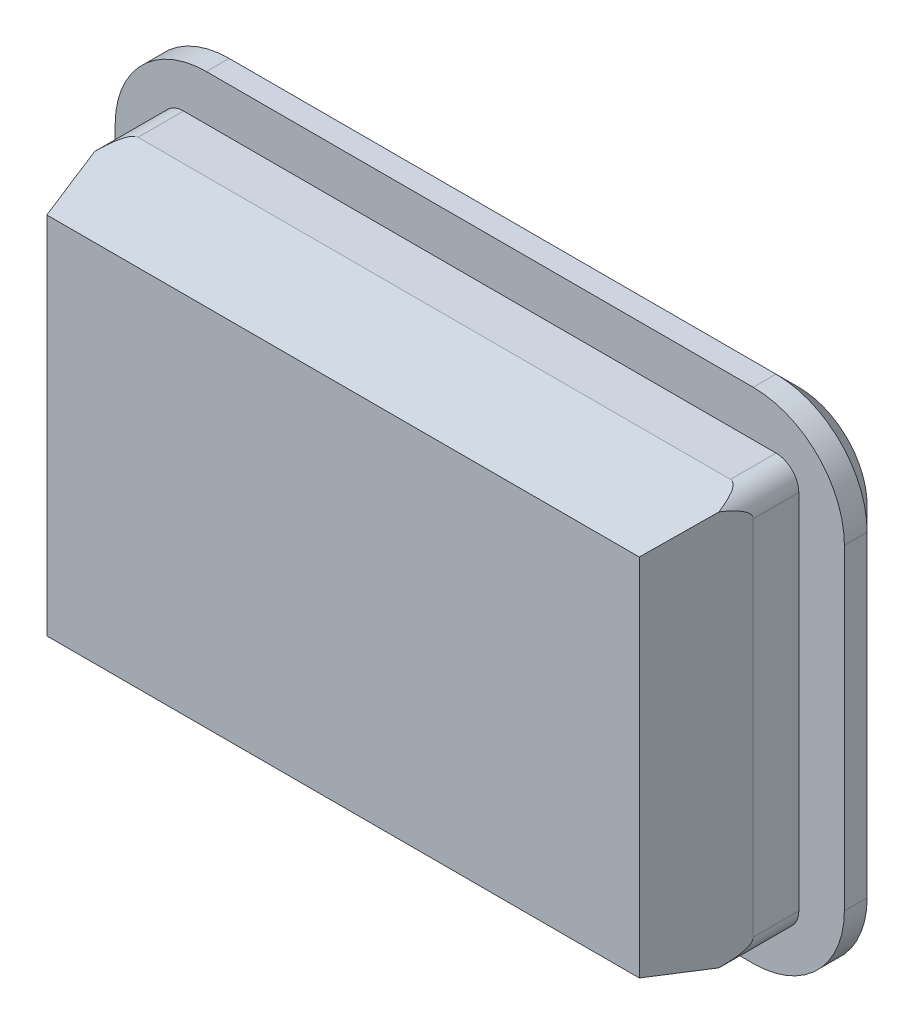
ISO-10303-21;
HEADER;
FILE_DESCRIPTION(('STEP AP214'),'2;1');
FILE_NAME('part.step','',(''),(''),'','','');
FILE_SCHEMA(('AUTOMOTIVE_DESIGN { 1 0 10303 214 1 1 1 1 }'));
ENDSEC;
DATA;
#1=APPLICATION_CONTEXT('core data for automotive mechanical design processes');
#2=APPLICATION_PROTOCOL_DEFINITION('international standard','automotive_design',2000,#1);
#3=PRODUCT_CONTEXT('',#1,'mechanical');
#4=PRODUCT('Part','Part','',(#3));
#5=PRODUCT_RELATED_PRODUCT_CATEGORY('part','',(#4));
#6=PRODUCT_DEFINITION_FORMATION('','',#4);
#7=PRODUCT_DEFINITION_CONTEXT('part definition',#1,'design');
#8=PRODUCT_DEFINITION('design','',#6,#7);
#9=PRODUCT_DEFINITION_SHAPE('','',#8);
#10=(LENGTH_UNIT() NAMED_UNIT(*) SI_UNIT(.MILLI.,.METRE.));
#11=(NAMED_UNIT(*) PLANE_ANGLE_UNIT() SI_UNIT($,.RADIAN.));
#12=(NAMED_UNIT(*) SI_UNIT($,.STERADIAN.) SOLID_ANGLE_UNIT());
#13=UNCERTAINTY_MEASURE_WITH_UNIT(LENGTH_MEASURE(1.E-05),#10,'distance_accuracy_value','');
#14=(GEOMETRIC_REPRESENTATION_CONTEXT(3) GLOBAL_UNCERTAINTY_ASSIGNED_CONTEXT((#13)) GLOBAL_UNIT_ASSIGNED_CONTEXT((#10,
#11,#12)) REPRESENTATION_CONTEXT('',''));
#15=CARTESIAN_POINT('',(0.,0.,0.));
#16=DIRECTION('',(0.,0.,1.));
#17=DIRECTION('',(1.,0.,0.));
#18=AXIS2_PLACEMENT_3D('',#15,#16,#17);
#19=CARTESIAN_POINT('',(0.,0.,2.));
#20=DIRECTION('',(0.,0.,-1.));
#21=DIRECTION('',(-1.,0.,0.));
#22=AXIS2_PLACEMENT_3D('',#19,#20,#21);
#23=PLANE('',#22);
#24=DIRECTION('',(0.,1.,0.));
#25=VECTOR('',#24,1.);
#26=CARTESIAN_POINT('',(6.5,-4.,2.));
#27=LINE('',#26,#25);
#28=CARTESIAN_POINT('',(6.5,-4.,2.));
#29=VERTEX_POINT('',#28);
#30=CARTESIAN_POINT('',(6.5,4.,2.));
#31=VERTEX_POINT('',#30);
#32=EDGE_CURVE('E280',#29,#31,#27,.T.);
#33=ORIENTED_EDGE('',*,*,#32,.T.);
#34=DIRECTION('',(-1.,0.,0.));
#35=VECTOR('',#34,1.);
#36=CARTESIAN_POINT('',(-6.5,4.,2.));
#37=LINE('',#36,#35);
#38=CARTESIAN_POINT('',(-6.5,4.,2.));
#39=VERTEX_POINT('',#38);
#40=EDGE_CURVE('E236',#31,#39,#37,.T.);
#41=ORIENTED_EDGE('',*,*,#40,.T.);
#42=DIRECTION('',(0.,-1.,0.));
#43=VECTOR('',#42,1.);
#44=CARTESIAN_POINT('',(-6.5,-4.,2.));
#45=LINE('',#44,#43);
#46=CARTESIAN_POINT('',(-6.5,-4.,2.));
#47=VERTEX_POINT('',#46);
#48=EDGE_CURVE('E212',#39,#47,#45,.T.);
#49=ORIENTED_EDGE('',*,*,#48,.T.);
#50=DIRECTION('',(1.,0.,0.));
#51=VECTOR('',#50,1.);
#52=CARTESIAN_POINT('',(-6.5,-4.,2.));
#53=LINE('',#52,#51);
#54=EDGE_CURVE('E222',#47,#29,#53,.T.);
#55=ORIENTED_EDGE('',*,*,#54,.T.);
#56=EDGE_LOOP('',(#33,#41,#49,#55));
#57=FACE_BOUND('',#56,.T.);
#58=ADVANCED_FACE('F43',(#57),#23,.F.);
#59=CARTESIAN_POINT('',(6.58823529411765,0.,1.64705882352942));
#60=DIRECTION('',(0.970142500145332,0.,0.242535625036334));
#61=DIRECTION('',(0.242535625036334,0.,-0.970142500145332));
#62=AXIS2_PLACEMENT_3D('',#59,#60,#61);
#63=PLANE('',#62);
#64=DIRECTION('',(0.236343225784556,-0.224526064495328,-0.945372903138222));
#65=VECTOR('',#64,1.);
#66=CARTESIAN_POINT('',(6.5,-4.,2.));
#67=LINE('',#66,#65);
#68=CARTESIAN_POINT('',(6.84977789098792,-4.33228899643852,0.600888436048335));
#69=VERTEX_POINT('',#68);
#70=EDGE_CURVE('E226',#29,#69,#67,.T.);
#71=ORIENTED_EDGE('',*,*,#70,.T.);
#72=CARTESIAN_POINT('',(6.5,-3.975,1.99999999999999));
#73=DIRECTION('',(0.970142500145332,0.,0.242535625036334));
#74=DIRECTION('',(-0.242535625036334,0.,0.970142500145332));
#75=AXIS2_PLACEMENT_3D('',#72,#73,#74);
#76=ELLIPSE('',#75,2.06155281280882,0.5);
#77=CARTESIAN_POINT('',(7.,-3.975,0.));
#78=VERTEX_POINT('',#77);
#79=EDGE_CURVE('E869',#69,#78,#76,.T.);
#80=ORIENTED_EDGE('',*,*,#79,.T.);
#81=DIRECTION('',(0.,1.,0.));
#82=VECTOR('',#81,1.);
#83=CARTESIAN_POINT('',(7.,-4.475,0.));
#84=LINE('',#83,#82);
#85=CARTESIAN_POINT('',(7.,3.975,0.));
#86=VERTEX_POINT('',#85);
#87=EDGE_CURVE('E300',#78,#86,#84,.T.);
#88=ORIENTED_EDGE('',*,*,#87,.T.);
#89=CARTESIAN_POINT('',(6.5,3.975,1.99999999999999));
#90=DIRECTION('',(0.970142500145332,0.,0.242535625036334));
#91=DIRECTION('',(-0.242535625036334,0.,0.970142500145332));
#92=AXIS2_PLACEMENT_3D('',#89,#90,#91);
#93=ELLIPSE('',#92,2.06155281280882,0.5);
#94=CARTESIAN_POINT('',(6.84977789098792,4.33228899643852,0.600888436048335));
#95=VERTEX_POINT('',#94);
#96=EDGE_CURVE('E868',#86,#95,#93,.T.);
#97=ORIENTED_EDGE('',*,*,#96,.T.);
#98=DIRECTION('',(0.236343225784556,0.224526064495328,-0.945372903138222));
#99=VECTOR('',#98,1.);
#100=CARTESIAN_POINT('',(6.5,4.,2.));
#101=LINE('',#100,#99);
#102=EDGE_CURVE('E219',#31,#95,#101,.T.);
#103=ORIENTED_EDGE('',*,*,#102,.F.);
#104=ORIENTED_EDGE('',*,*,#32,.F.);
#105=EDGE_LOOP('',(#71,#80,#88,#97,#103,#104));
#106=FACE_BOUND('',#105,.T.);
#107=ADVANCED_FACE('F256',(#106),#63,.T.);
#108=CARTESIAN_POINT('',(0.,4.23605975447419,1.00606419168762));
#109=DIRECTION('',(0.,0.972936550719561,0.231072430795896));
#110=DIRECTION('',(0.,-0.231072430795896,0.972936550719561));
#111=AXIS2_PLACEMENT_3D('',#108,#109,#110);
#112=PLANE('',#111);
#113=DIRECTION('',(-1.,0.,0.));
#114=VECTOR('',#113,1.);
#115=CARTESIAN_POINT('',(-7.,4.475,0.));
#116=LINE('',#115,#114);
#117=CARTESIAN_POINT('',(6.5,4.475,0.));
#118=VERTEX_POINT('',#117);
#119=CARTESIAN_POINT('',(-6.5,4.475,0.));
#120=VERTEX_POINT('',#119);
#121=EDGE_CURVE('E47',#118,#120,#116,.T.);
#122=ORIENTED_EDGE('',*,*,#121,.T.);
#123=CARTESIAN_POINT('',(-6.5,3.975,2.10526315789474));
#124=DIRECTION('',(0.,0.972936550719561,0.231072430795896));
#125=DIRECTION('',(0.,-0.231072430795896,0.972936550719561));
#126=AXIS2_PLACEMENT_3D('',#123,#124,#125);
#127=ELLIPSE('',#126,2.16382369059702,0.5);
#128=CARTESIAN_POINT('',(-6.84977789098792,4.33228899643852,0.600888436048336));
#129=VERTEX_POINT('',#128);
#130=EDGE_CURVE('E908',#120,#129,#127,.T.);
#131=ORIENTED_EDGE('',*,*,#130,.T.);
#132=DIRECTION('',(-0.236343225784555,0.224526064495328,-0.945372903138222));
#133=VECTOR('',#132,1.);
#134=CARTESIAN_POINT('',(-6.5,4.,2.));
#135=LINE('',#134,#133);
#136=EDGE_CURVE('E218',#39,#129,#135,.T.);
#137=ORIENTED_EDGE('',*,*,#136,.F.);
#138=ORIENTED_EDGE('',*,*,#40,.F.);
#139=ORIENTED_EDGE('',*,*,#102,.T.);
#140=CARTESIAN_POINT('',(6.5,3.975,2.10526315789474));
#141=DIRECTION('',(0.,0.972936550719561,0.231072430795896));
#142=DIRECTION('',(0.,-0.231072430795896,0.972936550719561));
#143=AXIS2_PLACEMENT_3D('',#140,#141,#142);
#144=ELLIPSE('',#143,2.16382369059702,0.5);
#145=EDGE_CURVE('E906',#95,#118,#144,.T.);
#146=ORIENTED_EDGE('',*,*,#145,.T.);
#147=EDGE_LOOP('',(#122,#131,#137,#138,#139,#146));
#148=FACE_BOUND('',#147,.T.);
#149=ADVANCED_FACE('F322',(#148),#112,.T.);
#150=CARTESIAN_POINT('',(0.,-4.23605975447419,1.00606419168762));
#151=DIRECTION('',(0.,-0.972936550719561,0.231072430795895));
#152=DIRECTION('',(0.,-0.231072430795896,-0.972936550719561));
#153=AXIS2_PLACEMENT_3D('',#150,#151,#152);
#154=PLANE('',#153);
#155=DIRECTION('',(-0.236343225784555,-0.224526064495328,-0.945372903138222));
#156=VECTOR('',#155,1.);
#157=CARTESIAN_POINT('',(-6.5,-4.,2.));
#158=LINE('',#157,#156);
#159=CARTESIAN_POINT('',(-6.84977789098792,-4.33228899643852,0.600888436048336));
#160=VERTEX_POINT('',#159);
#161=EDGE_CURVE('E206',#47,#160,#158,.T.);
#162=ORIENTED_EDGE('',*,*,#161,.T.);
#163=CARTESIAN_POINT('',(-6.5,-3.975,2.10526315789474));
#164=DIRECTION('',(0.,-0.972936550719561,0.231072430795895));
#165=DIRECTION('',(0.,0.231072430795896,0.972936550719561));
#166=AXIS2_PLACEMENT_3D('',#163,#164,#165);
#167=ELLIPSE('',#166,2.16382369059702,0.5);
#168=CARTESIAN_POINT('',(-6.5,-4.475,0.));
#169=VERTEX_POINT('',#168);
#170=EDGE_CURVE('E893',#160,#169,#167,.T.);
#171=ORIENTED_EDGE('',*,*,#170,.T.);
#172=DIRECTION('',(1.,0.,0.));
#173=VECTOR('',#172,1.);
#174=CARTESIAN_POINT('',(-7.,-4.475,0.));
#175=LINE('',#174,#173);
#176=CARTESIAN_POINT('',(6.5,-4.475,0.));
#177=VERTEX_POINT('',#176);
#178=EDGE_CURVE('E295',#169,#177,#175,.T.);
#179=ORIENTED_EDGE('',*,*,#178,.T.);
#180=CARTESIAN_POINT('',(6.5,-3.975,2.10526315789474));
#181=DIRECTION('',(0.,-0.972936550719561,0.231072430795895));
#182=DIRECTION('',(0.,0.231072430795896,0.972936550719561));
#183=AXIS2_PLACEMENT_3D('',#180,#181,#182);
#184=ELLIPSE('',#183,2.16382369059702,0.5);
#185=EDGE_CURVE('E428',#177,#69,#184,.T.);
#186=ORIENTED_EDGE('',*,*,#185,.T.);
#187=ORIENTED_EDGE('',*,*,#70,.F.);
#188=ORIENTED_EDGE('',*,*,#54,.F.);
#189=EDGE_LOOP('',(#162,#171,#179,#186,#187,#188));
#190=FACE_BOUND('',#189,.T.);
#191=ADVANCED_FACE('F224',(#190),#154,.T.);
#192=CARTESIAN_POINT('',(-6.58823529411765,0.,1.64705882352941));
#193=DIRECTION('',(-0.970142500145332,0.,0.242535625036333));
#194=DIRECTION('',(0.242535625036333,0.,0.970142500145332));
#195=AXIS2_PLACEMENT_3D('',#192,#193,#194);
#196=PLANE('',#195);
#197=DIRECTION('',(0.,-1.,0.));
#198=VECTOR('',#197,1.);
#199=CARTESIAN_POINT('',(-7.,-4.475,0.));
#200=LINE('',#199,#198);
#201=CARTESIAN_POINT('',(-7.,3.975,0.));
#202=VERTEX_POINT('',#201);
#203=CARTESIAN_POINT('',(-7.,-3.975,0.));
#204=VERTEX_POINT('',#203);
#205=EDGE_CURVE('E299',#202,#204,#200,.T.);
#206=ORIENTED_EDGE('',*,*,#205,.T.);
#207=CARTESIAN_POINT('',(-6.5,-3.975,1.99999999999999));
#208=DIRECTION('',(-0.970142500145332,0.,0.242535625036333));
#209=DIRECTION('',(0.242535625036333,0.,0.970142500145332));
#210=AXIS2_PLACEMENT_3D('',#207,#208,#209);
#211=ELLIPSE('',#210,2.06155281280883,0.5);
#212=EDGE_CURVE('E215',#204,#160,#211,.T.);
#213=ORIENTED_EDGE('',*,*,#212,.T.);
#214=ORIENTED_EDGE('',*,*,#161,.F.);
#215=ORIENTED_EDGE('',*,*,#48,.F.);
#216=ORIENTED_EDGE('',*,*,#136,.T.);
#217=CARTESIAN_POINT('',(-6.5,3.975,1.99999999999999));
#218=DIRECTION('',(-0.970142500145332,0.,0.242535625036333));
#219=DIRECTION('',(0.242535625036333,0.,0.970142500145332));
#220=AXIS2_PLACEMENT_3D('',#217,#218,#219);
#221=ELLIPSE('',#220,2.06155281280883,0.5);
#222=EDGE_CURVE('E421',#129,#202,#221,.T.);
#223=ORIENTED_EDGE('',*,*,#222,.T.);
#224=EDGE_LOOP('',(#206,#213,#214,#215,#216,#223));
#225=FACE_BOUND('',#224,.T.);
#226=ADVANCED_FACE('F209',(#225),#196,.T.);
#227=CARTESIAN_POINT('',(-7.,4.475,-1.));
#228=DIRECTION('',(0.,-1.,0.));
#229=DIRECTION('',(0.,0.,-1.));
#230=AXIS2_PLACEMENT_3D('',#227,#228,#229);
#231=PLANE('',#230);
#232=DIRECTION('',(1.,0.,0.));
#233=VECTOR('',#232,1.);
#234=CARTESIAN_POINT('',(-7.,4.475,-1.));
#235=LINE('',#234,#233);
#236=CARTESIAN_POINT('',(-6.5,4.475,-1.));
#237=VERTEX_POINT('',#236);
#238=CARTESIAN_POINT('',(6.5,4.475,-1.));
#239=VERTEX_POINT('',#238);
#240=EDGE_CURVE('E463',#237,#239,#235,.T.);
#241=ORIENTED_EDGE('',*,*,#240,.F.);
#242=DIRECTION('',(0.,0.,1.));
#243=VECTOR('',#242,1.);
#244=CARTESIAN_POINT('',(-6.5,4.475,-1.));
#245=LINE('',#244,#243);
#246=EDGE_CURVE('E904',#237,#120,#245,.T.);
#247=ORIENTED_EDGE('',*,*,#246,.T.);
#248=ORIENTED_EDGE('',*,*,#121,.F.);
#249=DIRECTION('',(0.,0.,1.));
#250=VECTOR('',#249,1.);
#251=CARTESIAN_POINT('',(6.5,4.475,-1.));
#252=LINE('',#251,#250);
#253=EDGE_CURVE('E359',#118,#239,#252,.F.);
#254=ORIENTED_EDGE('',*,*,#253,.T.);
#255=EDGE_LOOP('',(#241,#247,#248,#254));
#256=FACE_BOUND('',#255,.T.);
#257=ADVANCED_FACE('F257',(#256),#231,.F.);
#258=CARTESIAN_POINT('',(7.,4.475,-1.));
#259=DIRECTION('',(-1.,0.,0.));
#260=DIRECTION('',(0.,0.,1.));
#261=AXIS2_PLACEMENT_3D('',#258,#259,#260);
#262=PLANE('',#261);
#263=ORIENTED_EDGE('',*,*,#87,.F.);
#264=DIRECTION('',(0.,0.,1.));
#265=VECTOR('',#264,1.);
#266=CARTESIAN_POINT('',(7.,-3.975,-1.));
#267=LINE('',#266,#265);
#268=CARTESIAN_POINT('',(7.,-3.975,-1.));
#269=VERTEX_POINT('',#268);
#270=EDGE_CURVE('E61',#78,#269,#267,.F.);
#271=ORIENTED_EDGE('',*,*,#270,.T.);
#272=DIRECTION('',(0.,-1.,0.));
#273=VECTOR('',#272,1.);
#274=CARTESIAN_POINT('',(7.,4.475,-1.));
#275=LINE('',#274,#273);
#276=CARTESIAN_POINT('',(7.,3.975,-1.));
#277=VERTEX_POINT('',#276);
#278=EDGE_CURVE('E459',#277,#269,#275,.T.);
#279=ORIENTED_EDGE('',*,*,#278,.F.);
#280=DIRECTION('',(0.,0.,1.));
#281=VECTOR('',#280,1.);
#282=CARTESIAN_POINT('',(7.,3.975,-1.));
#283=LINE('',#282,#281);
#284=EDGE_CURVE('E867',#277,#86,#283,.T.);
#285=ORIENTED_EDGE('',*,*,#284,.T.);
#286=EDGE_LOOP('',(#263,#271,#279,#285));
#287=FACE_BOUND('',#286,.T.);
#288=ADVANCED_FACE('F378',(#287),#262,.F.);
#289=CARTESIAN_POINT('',(7.,-4.475,-1.));
#290=DIRECTION('',(0.,1.,0.));
#291=DIRECTION('',(0.,0.,1.));
#292=AXIS2_PLACEMENT_3D('',#289,#290,#291);
#293=PLANE('',#292);
#294=ORIENTED_EDGE('',*,*,#178,.F.);
#295=DIRECTION('',(0.,0.,1.));
#296=VECTOR('',#295,1.);
#297=CARTESIAN_POINT('',(-6.5,-4.475,-1.));
#298=LINE('',#297,#296);
#299=CARTESIAN_POINT('',(-6.5,-4.475,-1.));
#300=VERTEX_POINT('',#299);
#301=EDGE_CURVE('E892',#169,#300,#298,.F.);
#302=ORIENTED_EDGE('',*,*,#301,.T.);
#303=DIRECTION('',(-1.,0.,0.));
#304=VECTOR('',#303,1.);
#305=CARTESIAN_POINT('',(7.,-4.475,-1.));
#306=LINE('',#305,#304);
#307=CARTESIAN_POINT('',(6.5,-4.475,-1.));
#308=VERTEX_POINT('',#307);
#309=EDGE_CURVE('E454',#308,#300,#306,.T.);
#310=ORIENTED_EDGE('',*,*,#309,.F.);
#311=DIRECTION('',(0.,0.,1.));
#312=VECTOR('',#311,1.);
#313=CARTESIAN_POINT('',(6.5,-4.475,-1.));
#314=LINE('',#313,#312);
#315=EDGE_CURVE('E890',#308,#177,#314,.T.);
#316=ORIENTED_EDGE('',*,*,#315,.T.);
#317=EDGE_LOOP('',(#294,#302,#310,#316));
#318=FACE_BOUND('',#317,.T.);
#319=ADVANCED_FACE('F386',(#318),#293,.F.);
#320=CARTESIAN_POINT('',(-7.,-4.475,-1.));
#321=DIRECTION('',(1.,0.,0.));
#322=DIRECTION('',(0.,0.,-1.));
#323=AXIS2_PLACEMENT_3D('',#320,#321,#322);
#324=PLANE('',#323);
#325=DIRECTION('',(0.,1.,0.));
#326=VECTOR('',#325,1.);
#327=CARTESIAN_POINT('',(-7.,-4.475,-1.));
#328=LINE('',#327,#326);
#329=CARTESIAN_POINT('',(-7.,-3.975,-1.));
#330=VERTEX_POINT('',#329);
#331=CARTESIAN_POINT('',(-7.,3.975,-1.));
#332=VERTEX_POINT('',#331);
#333=EDGE_CURVE('E452',#330,#332,#328,.T.);
#334=ORIENTED_EDGE('',*,*,#333,.F.);
#335=DIRECTION('',(0.,0.,1.));
#336=VECTOR('',#335,1.);
#337=CARTESIAN_POINT('',(-7.,-3.975,-1.));
#338=LINE('',#337,#336);
#339=EDGE_CURVE('E416',#330,#204,#338,.T.);
#340=ORIENTED_EDGE('',*,*,#339,.T.);
#341=ORIENTED_EDGE('',*,*,#205,.F.);
#342=DIRECTION('',(0.,0.,1.));
#343=VECTOR('',#342,1.);
#344=CARTESIAN_POINT('',(-7.,3.975,-1.));
#345=LINE('',#344,#343);
#346=EDGE_CURVE('E414',#202,#332,#345,.F.);
#347=ORIENTED_EDGE('',*,*,#346,.T.);
#348=EDGE_LOOP('',(#334,#340,#341,#347));
#349=FACE_BOUND('',#348,.T.);
#350=ADVANCED_FACE('F390',(#349),#324,.F.);
#351=CARTESIAN_POINT('',(-8.,-5.475,-2.));
#352=DIRECTION('',(1.,0.,0.));
#353=DIRECTION('',(0.,0.,-1.));
#354=AXIS2_PLACEMENT_3D('',#351,#352,#353);
#355=PLANE('',#354);
#356=DIRECTION('',(0.,0.,1.));
#357=VECTOR('',#356,1.);
#358=CARTESIAN_POINT('',(-8.,3.475,-2.));
#359=LINE('',#358,#357);
#360=CARTESIAN_POINT('',(-8.,3.475,-1.));
#361=VERTEX_POINT('',#360);
#362=CARTESIAN_POINT('',(-8.,3.475,-1.5));
#363=VERTEX_POINT('',#362);
#364=EDGE_CURVE('E298',#361,#363,#359,.F.);
#365=ORIENTED_EDGE('',*,*,#364,.T.);
#366=DIRECTION('',(0.,-1.,0.));
#367=VECTOR('',#366,1.);
#368=CARTESIAN_POINT('',(-8.,-5.475,-1.5));
#369=LINE('',#368,#367);
#370=CARTESIAN_POINT('',(-8.,-3.475,-1.5));
#371=VERTEX_POINT('',#370);
#372=EDGE_CURVE('E513',#363,#371,#369,.T.);
#373=ORIENTED_EDGE('',*,*,#372,.T.);
#374=DIRECTION('',(0.,0.,1.));
#375=VECTOR('',#374,1.);
#376=CARTESIAN_POINT('',(-8.,-3.475,-2.));
#377=LINE('',#376,#375);
#378=CARTESIAN_POINT('',(-8.,-3.475,-1.));
#379=VERTEX_POINT('',#378);
#380=EDGE_CURVE('E561',#371,#379,#377,.T.);
#381=ORIENTED_EDGE('',*,*,#380,.T.);
#382=DIRECTION('',(0.,1.,0.));
#383=VECTOR('',#382,1.);
#384=CARTESIAN_POINT('',(-8.,-5.475,-1.));
#385=LINE('',#384,#383);
#386=EDGE_CURVE('E474',#379,#361,#385,.T.);
#387=ORIENTED_EDGE('',*,*,#386,.T.);
#388=EDGE_LOOP('',(#365,#373,#381,#387));
#389=FACE_BOUND('',#388,.T.);
#390=ADVANCED_FACE('F395',(#389),#355,.F.);
#391=CARTESIAN_POINT('',(8.,5.475,-2.));
#392=DIRECTION('',(0.,-1.,0.));
#393=DIRECTION('',(0.,0.,-1.));
#394=AXIS2_PLACEMENT_3D('',#391,#392,#393);
#395=PLANE('',#394);
#396=DIRECTION('',(0.,0.,1.));
#397=VECTOR('',#396,1.);
#398=CARTESIAN_POINT('',(6.,5.475,-2.));
#399=LINE('',#398,#397);
#400=CARTESIAN_POINT('',(6.,5.475,-1.));
#401=VERTEX_POINT('',#400);
#402=CARTESIAN_POINT('',(6.,5.475,-1.5));
#403=VERTEX_POINT('',#402);
#404=EDGE_CURVE('E546',#401,#403,#399,.F.);
#405=ORIENTED_EDGE('',*,*,#404,.T.);
#406=DIRECTION('',(-1.,0.,0.));
#407=VECTOR('',#406,1.);
#408=CARTESIAN_POINT('',(8.,5.475,-1.5));
#409=LINE('',#408,#407);
#410=CARTESIAN_POINT('',(-6.,5.475,-1.5));
#411=VERTEX_POINT('',#410);
#412=EDGE_CURVE('E417',#403,#411,#409,.T.);
#413=ORIENTED_EDGE('',*,*,#412,.T.);
#414=DIRECTION('',(0.,0.,1.));
#415=VECTOR('',#414,1.);
#416=CARTESIAN_POINT('',(-6.,5.475,-2.));
#417=LINE('',#416,#415);
#418=CARTESIAN_POINT('',(-6.,5.475,-1.));
#419=VERTEX_POINT('',#418);
#420=EDGE_CURVE('E544',#411,#419,#417,.T.);
#421=ORIENTED_EDGE('',*,*,#420,.T.);
#422=DIRECTION('',(1.,0.,0.));
#423=VECTOR('',#422,1.);
#424=CARTESIAN_POINT('',(8.,5.475,-1.));
#425=LINE('',#424,#423);
#426=EDGE_CURVE('E471',#419,#401,#425,.T.);
#427=ORIENTED_EDGE('',*,*,#426,.T.);
#428=EDGE_LOOP('',(#405,#413,#421,#427));
#429=FACE_BOUND('',#428,.T.);
#430=ADVANCED_FACE('F618',(#429),#395,.F.);
#431=CARTESIAN_POINT('',(8.,-5.475,-2.));
#432=DIRECTION('',(-1.,0.,0.));
#433=DIRECTION('',(0.,0.,1.));
#434=AXIS2_PLACEMENT_3D('',#431,#432,#433);
#435=PLANE('',#434);
#436=DIRECTION('',(0.,0.,1.));
#437=VECTOR('',#436,1.);
#438=CARTESIAN_POINT('',(8.,-3.475,-2.));
#439=LINE('',#438,#437);
#440=CARTESIAN_POINT('',(8.,-3.475,-1.));
#441=VERTEX_POINT('',#440);
#442=CARTESIAN_POINT('',(8.,-3.475,-1.5));
#443=VERTEX_POINT('',#442);
#444=EDGE_CURVE('E539',#441,#443,#439,.F.);
#445=ORIENTED_EDGE('',*,*,#444,.T.);
#446=DIRECTION('',(0.,1.,0.));
#447=VECTOR('',#446,1.);
#448=CARTESIAN_POINT('',(8.,-5.475,-1.5));
#449=LINE('',#448,#447);
#450=CARTESIAN_POINT('',(8.,3.475,-1.5));
#451=VERTEX_POINT('',#450);
#452=EDGE_CURVE('E511',#443,#451,#449,.T.);
#453=ORIENTED_EDGE('',*,*,#452,.T.);
#454=DIRECTION('',(0.,0.,1.));
#455=VECTOR('',#454,1.);
#456=CARTESIAN_POINT('',(8.,3.475,-2.));
#457=LINE('',#456,#455);
#458=CARTESIAN_POINT('',(8.,3.475,-1.));
#459=VERTEX_POINT('',#458);
#460=EDGE_CURVE('E542',#451,#459,#457,.T.);
#461=ORIENTED_EDGE('',*,*,#460,.T.);
#462=DIRECTION('',(0.,-1.,0.));
#463=VECTOR('',#462,1.);
#464=CARTESIAN_POINT('',(8.,-5.475,-1.));
#465=LINE('',#464,#463);
#466=EDGE_CURVE('E468',#459,#441,#465,.T.);
#467=ORIENTED_EDGE('',*,*,#466,.T.);
#468=EDGE_LOOP('',(#445,#453,#461,#467));
#469=FACE_BOUND('',#468,.T.);
#470=ADVANCED_FACE('F604',(#469),#435,.F.);
#471=CARTESIAN_POINT('',(8.,-5.475,-2.));
#472=DIRECTION('',(0.,1.,0.));
#473=DIRECTION('',(0.,0.,1.));
#474=AXIS2_PLACEMENT_3D('',#471,#472,#473);
#475=PLANE('',#474);
#476=DIRECTION('',(0.,0.,1.));
#477=VECTOR('',#476,1.);
#478=CARTESIAN_POINT('',(-6.,-5.475,-2.));
#479=LINE('',#478,#477);
#480=CARTESIAN_POINT('',(-6.,-5.475,-1.));
#481=VERTEX_POINT('',#480);
#482=CARTESIAN_POINT('',(-6.,-5.475,-1.5));
#483=VERTEX_POINT('',#482);
#484=EDGE_CURVE('E549',#481,#483,#479,.F.);
#485=ORIENTED_EDGE('',*,*,#484,.T.);
#486=DIRECTION('',(1.,0.,0.));
#487=VECTOR('',#486,1.);
#488=CARTESIAN_POINT('',(8.,-5.475,-1.5));
#489=LINE('',#488,#487);
#490=CARTESIAN_POINT('',(6.,-5.475,-1.5));
#491=VERTEX_POINT('',#490);
#492=EDGE_CURVE('E519',#483,#491,#489,.T.);
#493=ORIENTED_EDGE('',*,*,#492,.T.);
#494=DIRECTION('',(0.,0.,1.));
#495=VECTOR('',#494,1.);
#496=CARTESIAN_POINT('',(6.,-5.475,-2.));
#497=LINE('',#496,#495);
#498=CARTESIAN_POINT('',(6.,-5.475,-1.));
#499=VERTEX_POINT('',#498);
#500=EDGE_CURVE('E552',#491,#499,#497,.T.);
#501=ORIENTED_EDGE('',*,*,#500,.T.);
#502=DIRECTION('',(-1.,0.,0.));
#503=VECTOR('',#502,1.);
#504=CARTESIAN_POINT('',(8.,-5.475,-1.));
#505=LINE('',#504,#503);
#506=EDGE_CURVE('E465',#499,#481,#505,.T.);
#507=ORIENTED_EDGE('',*,*,#506,.T.);
#508=EDGE_LOOP('',(#485,#493,#501,#507));
#509=FACE_BOUND('',#508,.T.);
#510=ADVANCED_FACE('F586',(#509),#475,.F.);
#511=CARTESIAN_POINT('',(0.,0.,-2.));
#512=DIRECTION('',(0.,0.,1.));
#513=DIRECTION('',(1.,0.,0.));
#514=AXIS2_PLACEMENT_3D('',#511,#512,#513);
#515=PLANE('',#514);
#516=CARTESIAN_POINT('',(6.,-3.475,-2.));
#517=DIRECTION('',(0.,0.,1.));
#518=DIRECTION('',(1.,0.,0.));
#519=AXIS2_PLACEMENT_3D('',#516,#517,#518);
#520=CIRCLE('',#519,1.5);
#521=CARTESIAN_POINT('',(7.5,-3.475,-2.));
#522=VERTEX_POINT('',#521);
#523=CARTESIAN_POINT('',(6.,-4.975,-2.));
#524=VERTEX_POINT('',#523);
#525=EDGE_CURVE('E527',#522,#524,#520,.F.);
#526=ORIENTED_EDGE('',*,*,#525,.T.);
#527=DIRECTION('',(-1.,0.,0.));
#528=VECTOR('',#527,1.);
#529=CARTESIAN_POINT('',(0.,-4.975,-2.));
#530=LINE('',#529,#528);
#531=CARTESIAN_POINT('',(-6.,-4.975,-2.));
#532=VERTEX_POINT('',#531);
#533=EDGE_CURVE('E522',#524,#532,#530,.T.);
#534=ORIENTED_EDGE('',*,*,#533,.T.);
#535=CARTESIAN_POINT('',(-6.,-3.475,-2.));
#536=DIRECTION('',(0.,0.,1.));
#537=DIRECTION('',(1.,0.,0.));
#538=AXIS2_PLACEMENT_3D('',#535,#536,#537);
#539=CIRCLE('',#538,1.5);
#540=CARTESIAN_POINT('',(-7.5,-3.475,-2.));
#541=VERTEX_POINT('',#540);
#542=EDGE_CURVE('E525',#532,#541,#539,.F.);
#543=ORIENTED_EDGE('',*,*,#542,.T.);
#544=DIRECTION('',(0.,1.,0.));
#545=VECTOR('',#544,1.);
#546=CARTESIAN_POINT('',(-7.5,0.,-2.));
#547=LINE('',#546,#545);
#548=CARTESIAN_POINT('',(-7.5,3.475,-2.));
#549=VERTEX_POINT('',#548);
#550=EDGE_CURVE('E529',#541,#549,#547,.T.);
#551=ORIENTED_EDGE('',*,*,#550,.T.);
#552=CARTESIAN_POINT('',(-6.,3.475,-2.));
#553=DIRECTION('',(0.,0.,1.));
#554=DIRECTION('',(1.,0.,0.));
#555=AXIS2_PLACEMENT_3D('',#552,#553,#554);
#556=CIRCLE('',#555,1.5);
#557=CARTESIAN_POINT('',(-6.,4.975,-2.));
#558=VERTEX_POINT('',#557);
#559=EDGE_CURVE('E533',#549,#558,#556,.F.);
#560=ORIENTED_EDGE('',*,*,#559,.T.);
#561=DIRECTION('',(1.,0.,0.));
#562=VECTOR('',#561,1.);
#563=CARTESIAN_POINT('',(0.,4.975,-2.));
#564=LINE('',#563,#562);
#565=CARTESIAN_POINT('',(6.,4.975,-2.));
#566=VERTEX_POINT('',#565);
#567=EDGE_CURVE('E537',#558,#566,#564,.T.);
#568=ORIENTED_EDGE('',*,*,#567,.T.);
#569=CARTESIAN_POINT('',(6.,3.475,-2.));
#570=DIRECTION('',(0.,0.,1.));
#571=DIRECTION('',(1.,0.,0.));
#572=AXIS2_PLACEMENT_3D('',#569,#570,#571);
#573=CIRCLE('',#572,1.5);
#574=CARTESIAN_POINT('',(7.5,3.475,-2.));
#575=VERTEX_POINT('',#574);
#576=EDGE_CURVE('E535',#566,#575,#573,.F.);
#577=ORIENTED_EDGE('',*,*,#576,.T.);
#578=DIRECTION('',(0.,-1.,0.));
#579=VECTOR('',#578,1.);
#580=CARTESIAN_POINT('',(7.5,0.,-2.));
#581=LINE('',#580,#579);
#582=EDGE_CURVE('E531',#575,#522,#581,.T.);
#583=ORIENTED_EDGE('',*,*,#582,.T.);
#584=EDGE_LOOP('',(#526,#534,#543,#551,#560,#568,#577,#583));
#585=FACE_BOUND('',#584,.T.);
#586=ADVANCED_FACE('F626',(#585),#515,.F.);
#587=CARTESIAN_POINT('',(0.,0.,-1.));
#588=DIRECTION('',(0.,0.,1.));
#589=DIRECTION('',(1.,0.,0.));
#590=AXIS2_PLACEMENT_3D('',#587,#588,#589);
#591=PLANE('',#590);
#592=ORIENTED_EDGE('',*,*,#309,.T.);
#593=CARTESIAN_POINT('',(-6.5,-3.975,-1.));
#594=DIRECTION('',(0.,0.,1.));
#595=DIRECTION('',(1.,0.,0.));
#596=AXIS2_PLACEMENT_3D('',#593,#594,#595);
#597=CIRCLE('',#596,0.5);
#598=EDGE_CURVE('E871',#300,#330,#597,.F.);
#599=ORIENTED_EDGE('',*,*,#598,.T.);
#600=ORIENTED_EDGE('',*,*,#333,.T.);
#601=CARTESIAN_POINT('',(-6.5,3.975,-1.));
#602=DIRECTION('',(0.,0.,1.));
#603=DIRECTION('',(1.,0.,0.));
#604=AXIS2_PLACEMENT_3D('',#601,#602,#603);
#605=CIRCLE('',#604,0.5);
#606=EDGE_CURVE('E882',#332,#237,#605,.F.);
#607=ORIENTED_EDGE('',*,*,#606,.T.);
#608=ORIENTED_EDGE('',*,*,#240,.T.);
#609=CARTESIAN_POINT('',(6.5,3.975,-1.));
#610=DIRECTION('',(0.,0.,1.));
#611=DIRECTION('',(1.,0.,0.));
#612=AXIS2_PLACEMENT_3D('',#609,#610,#611);
#613=CIRCLE('',#612,0.5);
#614=EDGE_CURVE('E12',#239,#277,#613,.F.);
#615=ORIENTED_EDGE('',*,*,#614,.T.);
#616=ORIENTED_EDGE('',*,*,#278,.T.);
#617=CARTESIAN_POINT('',(6.5,-3.975,-1.));
#618=DIRECTION('',(0.,0.,1.));
#619=DIRECTION('',(1.,0.,0.));
#620=AXIS2_PLACEMENT_3D('',#617,#618,#619);
#621=CIRCLE('',#620,0.5);
#622=EDGE_CURVE('E53',#269,#308,#621,.F.);
#623=ORIENTED_EDGE('',*,*,#622,.T.);
#624=EDGE_LOOP('',(#592,#599,#600,#607,#608,#615,#616,#623));
#625=FACE_BOUND('',#624,.T.);
#626=ORIENTED_EDGE('',*,*,#386,.F.);
#627=CARTESIAN_POINT('',(-6.,-3.475,-1.));
#628=DIRECTION('',(0.,0.,1.));
#629=DIRECTION('',(1.,0.,0.));
#630=AXIS2_PLACEMENT_3D('',#627,#628,#629);
#631=CIRCLE('',#630,2.);
#632=EDGE_CURVE('E554',#379,#481,#631,.T.);
#633=ORIENTED_EDGE('',*,*,#632,.T.);
#634=ORIENTED_EDGE('',*,*,#506,.F.);
#635=CARTESIAN_POINT('',(6.,-3.475,-1.));
#636=DIRECTION('',(0.,0.,1.));
#637=DIRECTION('',(1.,0.,0.));
#638=AXIS2_PLACEMENT_3D('',#635,#636,#637);
#639=CIRCLE('',#638,2.);
#640=EDGE_CURVE('E558',#499,#441,#639,.T.);
#641=ORIENTED_EDGE('',*,*,#640,.T.);
#642=ORIENTED_EDGE('',*,*,#466,.F.);
#643=CARTESIAN_POINT('',(6.,3.475,-1.));
#644=DIRECTION('',(0.,0.,1.));
#645=DIRECTION('',(1.,0.,0.));
#646=AXIS2_PLACEMENT_3D('',#643,#644,#645);
#647=CIRCLE('',#646,2.);
#648=EDGE_CURVE('E560',#459,#401,#647,.T.);
#649=ORIENTED_EDGE('',*,*,#648,.T.);
#650=ORIENTED_EDGE('',*,*,#426,.F.);
#651=CARTESIAN_POINT('',(-6.,3.475,-1.));
#652=DIRECTION('',(0.,0.,1.));
#653=DIRECTION('',(1.,0.,0.));
#654=AXIS2_PLACEMENT_3D('',#651,#652,#653);
#655=CIRCLE('',#654,2.);
#656=EDGE_CURVE('E556',#419,#361,#655,.T.);
#657=ORIENTED_EDGE('',*,*,#656,.T.);
#658=EDGE_LOOP('',(#626,#633,#634,#641,#642,#649,#650,#657));
#659=FACE_BOUND('',#658,.T.);
#660=ADVANCED_FACE('F628',(#625,#659),#591,.T.);
#661=CARTESIAN_POINT('',(-6.,-3.475,-2.));
#662=DIRECTION('',(0.,0.,1.));
#663=DIRECTION('',(1.,0.,0.));
#664=AXIS2_PLACEMENT_3D('',#661,#662,#663);
#665=CYLINDRICAL_SURFACE('',#664,2.);
#666=ORIENTED_EDGE('',*,*,#380,.F.);
#667=CARTESIAN_POINT('',(-6.,-3.475,-1.5));
#668=DIRECTION('',(0.,0.,1.));
#669=DIRECTION('',(1.,0.,0.));
#670=AXIS2_PLACEMENT_3D('',#667,#668,#669);
#671=CIRCLE('',#670,2.);
#672=EDGE_CURVE('E517',#371,#483,#671,.T.);
#673=ORIENTED_EDGE('',*,*,#672,.T.);
#674=ORIENTED_EDGE('',*,*,#484,.F.);
#675=ORIENTED_EDGE('',*,*,#632,.F.);
#676=EDGE_LOOP('',(#666,#673,#674,#675));
#677=FACE_BOUND('',#676,.T.);
#678=ADVANCED_FACE('F583',(#677),#665,.T.);
#679=CARTESIAN_POINT('',(-6.,3.475,-2.));
#680=DIRECTION('',(0.,0.,1.));
#681=DIRECTION('',(1.,0.,0.));
#682=AXIS2_PLACEMENT_3D('',#679,#680,#681);
#683=CYLINDRICAL_SURFACE('',#682,2.);
#684=ORIENTED_EDGE('',*,*,#420,.F.);
#685=CARTESIAN_POINT('',(-6.,3.475,-1.5));
#686=DIRECTION('',(0.,0.,1.));
#687=DIRECTION('',(1.,0.,0.));
#688=AXIS2_PLACEMENT_3D('',#685,#686,#687);
#689=CIRCLE('',#688,2.);
#690=EDGE_CURVE('E509',#411,#363,#689,.T.);
#691=ORIENTED_EDGE('',*,*,#690,.T.);
#692=ORIENTED_EDGE('',*,*,#364,.F.);
#693=ORIENTED_EDGE('',*,*,#656,.F.);
#694=EDGE_LOOP('',(#684,#691,#692,#693));
#695=FACE_BOUND('',#694,.T.);
#696=ADVANCED_FACE('F737',(#695),#683,.T.);
#697=CARTESIAN_POINT('',(6.,-3.475,-2.));
#698=DIRECTION('',(0.,0.,1.));
#699=DIRECTION('',(1.,0.,0.));
#700=AXIS2_PLACEMENT_3D('',#697,#698,#699);
#701=CYLINDRICAL_SURFACE('',#700,2.);
#702=ORIENTED_EDGE('',*,*,#500,.F.);
#703=CARTESIAN_POINT('',(6.,-3.475,-1.5));
#704=DIRECTION('',(0.,0.,1.));
#705=DIRECTION('',(1.,0.,0.));
#706=AXIS2_PLACEMENT_3D('',#703,#704,#705);
#707=CIRCLE('',#706,2.);
#708=EDGE_CURVE('E515',#491,#443,#707,.T.);
#709=ORIENTED_EDGE('',*,*,#708,.T.);
#710=ORIENTED_EDGE('',*,*,#444,.F.);
#711=ORIENTED_EDGE('',*,*,#640,.F.);
#712=EDGE_LOOP('',(#702,#709,#710,#711));
#713=FACE_BOUND('',#712,.T.);
#714=ADVANCED_FACE('F600',(#713),#701,.T.);
#715=CARTESIAN_POINT('',(6.,3.475,-2.));
#716=DIRECTION('',(0.,0.,1.));
#717=DIRECTION('',(1.,0.,0.));
#718=AXIS2_PLACEMENT_3D('',#715,#716,#717);
#719=CYLINDRICAL_SURFACE('',#718,2.);
#720=ORIENTED_EDGE('',*,*,#460,.F.);
#721=CARTESIAN_POINT('',(6.,3.475,-1.5));
#722=DIRECTION('',(0.,0.,1.));
#723=DIRECTION('',(1.,0.,0.));
#724=AXIS2_PLACEMENT_3D('',#721,#722,#723);
#725=CIRCLE('',#724,2.);
#726=EDGE_CURVE('E507',#451,#403,#725,.T.);
#727=ORIENTED_EDGE('',*,*,#726,.T.);
#728=ORIENTED_EDGE('',*,*,#404,.F.);
#729=ORIENTED_EDGE('',*,*,#648,.F.);
#730=EDGE_LOOP('',(#720,#727,#728,#729));
#731=FACE_BOUND('',#730,.T.);
#732=ADVANCED_FACE('F614',(#731),#719,.T.);
#733=CARTESIAN_POINT('',(0.,4.975,-2.));
#734=DIRECTION('',(0.,-0.707106781186549,0.707106781186546));
#735=DIRECTION('',(1.,0.,0.));
#736=AXIS2_PLACEMENT_3D('',#733,#734,#735);
#737=PLANE('',#736);
#738=DIRECTION('',(0.,-0.707106781186546,-0.707106781186549));
#739=VECTOR('',#738,1.);
#740=CARTESIAN_POINT('',(-6.,5.475,-1.5));
#741=LINE('',#740,#739);
#742=EDGE_CURVE('E482',#411,#558,#741,.T.);
#743=ORIENTED_EDGE('',*,*,#742,.F.);
#744=ORIENTED_EDGE('',*,*,#412,.F.);
#745=DIRECTION('',(0.,0.707106781186546,0.707106781186549));
#746=VECTOR('',#745,1.);
#747=CARTESIAN_POINT('',(6.,4.975,-2.));
#748=LINE('',#747,#746);
#749=EDGE_CURVE('E476',#566,#403,#748,.T.);
#750=ORIENTED_EDGE('',*,*,#749,.F.);
#751=ORIENTED_EDGE('',*,*,#567,.F.);
#752=EDGE_LOOP('',(#743,#744,#750,#751));
#753=FACE_BOUND('',#752,.T.);
#754=ADVANCED_FACE('F623',(#753),#737,.F.);
#755=CARTESIAN_POINT('',(6.,3.475,-2.));
#756=DIRECTION('',(0.,0.,1.));
#757=DIRECTION('',(1.,0.,0.));
#758=AXIS2_PLACEMENT_3D('',#755,#756,#757);
#759=CONICAL_SURFACE('',#758,1.5,0.785398163397447);
#760=ORIENTED_EDGE('',*,*,#749,.T.);
#761=ORIENTED_EDGE('',*,*,#726,.F.);
#762=DIRECTION('',(0.707106781186546,0.,0.707106781186549));
#763=VECTOR('',#762,1.);
#764=CARTESIAN_POINT('',(7.5,3.475,-2.));
#765=LINE('',#764,#763);
#766=EDGE_CURVE('E488',#575,#451,#765,.T.);
#767=ORIENTED_EDGE('',*,*,#766,.F.);
#768=ORIENTED_EDGE('',*,*,#576,.F.);
#769=EDGE_LOOP('',(#760,#761,#767,#768));
#770=FACE_BOUND('',#769,.T.);
#771=ADVANCED_FACE('F611',(#770),#759,.T.);
#772=CARTESIAN_POINT('',(-6.,3.475,-2.));
#773=DIRECTION('',(0.,0.,1.));
#774=DIRECTION('',(1.,0.,0.));
#775=AXIS2_PLACEMENT_3D('',#772,#773,#774);
#776=CONICAL_SURFACE('',#775,1.5,0.785398163397447);
#777=ORIENTED_EDGE('',*,*,#742,.T.);
#778=ORIENTED_EDGE('',*,*,#559,.F.);
#779=DIRECTION('',(0.707106781186546,0.,-0.707106781186549));
#780=VECTOR('',#779,1.);
#781=CARTESIAN_POINT('',(-8.,3.475,-1.5));
#782=LINE('',#781,#780);
#783=EDGE_CURVE('E493',#363,#549,#782,.T.);
#784=ORIENTED_EDGE('',*,*,#783,.F.);
#785=ORIENTED_EDGE('',*,*,#690,.F.);
#786=EDGE_LOOP('',(#777,#778,#784,#785));
#787=FACE_BOUND('',#786,.T.);
#788=ADVANCED_FACE('F571',(#787),#776,.T.);
#789=CARTESIAN_POINT('',(7.5,0.,-2.));
#790=DIRECTION('',(-0.707106781186549,0.,0.707106781186546));
#791=DIRECTION('',(0.,-1.,0.));
#792=AXIS2_PLACEMENT_3D('',#789,#790,#791);
#793=PLANE('',#792);
#794=ORIENTED_EDGE('',*,*,#766,.T.);
#795=ORIENTED_EDGE('',*,*,#452,.F.);
#796=DIRECTION('',(0.707106781186546,0.,0.707106781186549));
#797=VECTOR('',#796,1.);
#798=CARTESIAN_POINT('',(7.5,-3.475,-2.));
#799=LINE('',#798,#797);
#800=EDGE_CURVE('E496',#522,#443,#799,.T.);
#801=ORIENTED_EDGE('',*,*,#800,.F.);
#802=ORIENTED_EDGE('',*,*,#582,.F.);
#803=EDGE_LOOP('',(#794,#795,#801,#802));
#804=FACE_BOUND('',#803,.T.);
#805=ADVANCED_FACE('F608',(#804),#793,.F.);
#806=CARTESIAN_POINT('',(-7.5,0.,-2.));
#807=DIRECTION('',(0.707106781186549,0.,0.707106781186546));
#808=DIRECTION('',(0.,1.,0.));
#809=AXIS2_PLACEMENT_3D('',#806,#807,#808);
#810=PLANE('',#809);
#811=ORIENTED_EDGE('',*,*,#783,.T.);
#812=ORIENTED_EDGE('',*,*,#550,.F.);
#813=DIRECTION('',(0.707106781186546,0.,-0.707106781186549));
#814=VECTOR('',#813,1.);
#815=CARTESIAN_POINT('',(-8.,-3.475,-1.5));
#816=LINE('',#815,#814);
#817=EDGE_CURVE('E499',#371,#541,#816,.T.);
#818=ORIENTED_EDGE('',*,*,#817,.F.);
#819=ORIENTED_EDGE('',*,*,#372,.F.);
#820=EDGE_LOOP('',(#811,#812,#818,#819));
#821=FACE_BOUND('',#820,.T.);
#822=ADVANCED_FACE('F575',(#821),#810,.F.);
#823=CARTESIAN_POINT('',(6.,-3.475,-2.));
#824=DIRECTION('',(0.,0.,1.));
#825=DIRECTION('',(1.,0.,0.));
#826=AXIS2_PLACEMENT_3D('',#823,#824,#825);
#827=CONICAL_SURFACE('',#826,1.5,0.785398163397447);
#828=ORIENTED_EDGE('',*,*,#800,.T.);
#829=ORIENTED_EDGE('',*,*,#708,.F.);
#830=DIRECTION('',(0.,-0.707106781186546,0.707106781186549));
#831=VECTOR('',#830,1.);
#832=CARTESIAN_POINT('',(6.,-4.975,-2.));
#833=LINE('',#832,#831);
#834=EDGE_CURVE('E502',#524,#491,#833,.T.);
#835=ORIENTED_EDGE('',*,*,#834,.F.);
#836=ORIENTED_EDGE('',*,*,#525,.F.);
#837=EDGE_LOOP('',(#828,#829,#835,#836));
#838=FACE_BOUND('',#837,.T.);
#839=ADVANCED_FACE('F596',(#838),#827,.T.);
#840=CARTESIAN_POINT('',(-6.,-3.475,-2.));
#841=DIRECTION('',(0.,0.,1.));
#842=DIRECTION('',(1.,0.,0.));
#843=AXIS2_PLACEMENT_3D('',#840,#841,#842);
#844=CONICAL_SURFACE('',#843,1.5,0.785398163397447);
#845=ORIENTED_EDGE('',*,*,#817,.T.);
#846=ORIENTED_EDGE('',*,*,#542,.F.);
#847=DIRECTION('',(0.,0.707106781186546,-0.707106781186549));
#848=VECTOR('',#847,1.);
#849=CARTESIAN_POINT('',(-6.,-5.475,-1.5));
#850=LINE('',#849,#848);
#851=EDGE_CURVE('E504',#483,#532,#850,.T.);
#852=ORIENTED_EDGE('',*,*,#851,.F.);
#853=ORIENTED_EDGE('',*,*,#672,.F.);
#854=EDGE_LOOP('',(#845,#846,#852,#853));
#855=FACE_BOUND('',#854,.T.);
#856=ADVANCED_FACE('F580',(#855),#844,.T.);
#857=CARTESIAN_POINT('',(0.,-4.975,-2.));
#858=DIRECTION('',(0.,0.707106781186549,0.707106781186546));
#859=DIRECTION('',(-1.,0.,0.));
#860=AXIS2_PLACEMENT_3D('',#857,#858,#859);
#861=PLANE('',#860);
#862=ORIENTED_EDGE('',*,*,#834,.T.);
#863=ORIENTED_EDGE('',*,*,#492,.F.);
#864=ORIENTED_EDGE('',*,*,#851,.T.);
#865=ORIENTED_EDGE('',*,*,#533,.F.);
#866=EDGE_LOOP('',(#862,#863,#864,#865));
#867=FACE_BOUND('',#866,.T.);
#868=ADVANCED_FACE('F590',(#867),#861,.F.);
#869=CARTESIAN_POINT('',(-6.5,-3.975,-1.));
#870=DIRECTION('',(0.,0.,1.));
#871=DIRECTION('',(1.,0.,0.));
#872=AXIS2_PLACEMENT_3D('',#869,#870,#871);
#873=CYLINDRICAL_SURFACE('',#872,0.5);
#874=ORIENTED_EDGE('',*,*,#598,.F.);
#875=ORIENTED_EDGE('',*,*,#301,.F.);
#876=ORIENTED_EDGE('',*,*,#170,.F.);
#877=ORIENTED_EDGE('',*,*,#212,.F.);
#878=ORIENTED_EDGE('',*,*,#339,.F.);
#879=EDGE_LOOP('',(#874,#875,#876,#877,#878));
#880=FACE_BOUND('',#879,.T.);
#881=ADVANCED_FACE('F814',(#880),#873,.T.);
#882=CARTESIAN_POINT('',(-6.5,3.975,-1.));
#883=DIRECTION('',(0.,0.,1.));
#884=DIRECTION('',(1.,0.,0.));
#885=AXIS2_PLACEMENT_3D('',#882,#883,#884);
#886=CYLINDRICAL_SURFACE('',#885,0.5);
#887=ORIENTED_EDGE('',*,*,#606,.F.);
#888=ORIENTED_EDGE('',*,*,#346,.F.);
#889=ORIENTED_EDGE('',*,*,#222,.F.);
#890=ORIENTED_EDGE('',*,*,#130,.F.);
#891=ORIENTED_EDGE('',*,*,#246,.F.);
#892=EDGE_LOOP('',(#887,#888,#889,#890,#891));
#893=FACE_BOUND('',#892,.T.);
#894=ADVANCED_FACE('F821',(#893),#886,.T.);
#895=CARTESIAN_POINT('',(6.5,-3.975,-1.));
#896=DIRECTION('',(0.,0.,1.));
#897=DIRECTION('',(1.,0.,0.));
#898=AXIS2_PLACEMENT_3D('',#895,#896,#897);
#899=CYLINDRICAL_SURFACE('',#898,0.5);
#900=ORIENTED_EDGE('',*,*,#622,.F.);
#901=ORIENTED_EDGE('',*,*,#270,.F.);
#902=ORIENTED_EDGE('',*,*,#79,.F.);
#903=ORIENTED_EDGE('',*,*,#185,.F.);
#904=ORIENTED_EDGE('',*,*,#315,.F.);
#905=EDGE_LOOP('',(#900,#901,#902,#903,#904));
#906=FACE_BOUND('',#905,.T.);
#907=ADVANCED_FACE('F830',(#906),#899,.T.);
#908=CARTESIAN_POINT('',(6.5,3.975,-1.));
#909=DIRECTION('',(0.,0.,1.));
#910=DIRECTION('',(1.,0.,0.));
#911=AXIS2_PLACEMENT_3D('',#908,#909,#910);
#912=CYLINDRICAL_SURFACE('',#911,0.5);
#913=ORIENTED_EDGE('',*,*,#614,.F.);
#914=ORIENTED_EDGE('',*,*,#253,.F.);
#915=ORIENTED_EDGE('',*,*,#145,.F.);
#916=ORIENTED_EDGE('',*,*,#96,.F.);
#917=ORIENTED_EDGE('',*,*,#284,.F.);
#918=EDGE_LOOP('',(#913,#914,#915,#916,#917));
#919=FACE_BOUND('',#918,.T.);
#920=ADVANCED_FACE('F45',(#919),#912,.T.);
#921=CLOSED_SHELL('',(#58,#107,#149,#191,#226,#257,#288,#319,#350,#390,#430,#470,#510,#586,#660,
#678,#696,#714,#732,#754,#771,#788,#805,#822,#839,#856,#868,#881,#894,#907,#920));
#922=MANIFOLD_SOLID_BREP('B2',#921);
#923=ADVANCED_BREP_SHAPE_REPRESENTATION('',(#18,#922),#14);
#924=SHAPE_DEFINITION_REPRESENTATION(#9,#923);
ENDSEC;
END-ISO-10303-21;
